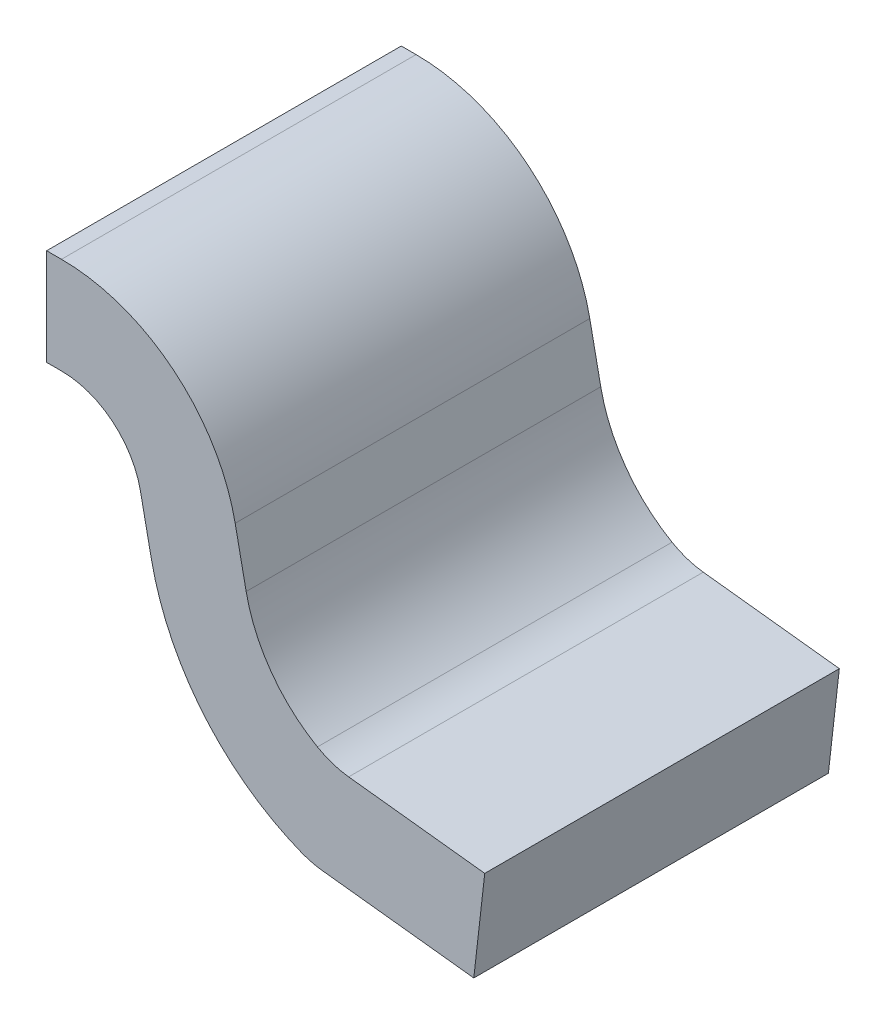
ISO-10303-21;
HEADER;
FILE_DESCRIPTION(('STEP AP214'),'2;1');
FILE_NAME('part.step','',(''),(''),'','','');
FILE_SCHEMA(('AUTOMOTIVE_DESIGN { 1 0 10303 214 1 1 1 1 }'));
ENDSEC;
DATA;
#1=APPLICATION_CONTEXT('core data for automotive mechanical design processes');
#2=APPLICATION_PROTOCOL_DEFINITION('international standard','automotive_design',2000,#1);
#3=PRODUCT_CONTEXT('',#1,'mechanical');
#4=PRODUCT('Part','Part','',(#3));
#5=PRODUCT_RELATED_PRODUCT_CATEGORY('part','',(#4));
#6=PRODUCT_DEFINITION_FORMATION('','',#4);
#7=PRODUCT_DEFINITION_CONTEXT('part definition',#1,'design');
#8=PRODUCT_DEFINITION('design','',#6,#7);
#9=PRODUCT_DEFINITION_SHAPE('','',#8);
#10=(LENGTH_UNIT() NAMED_UNIT(*) SI_UNIT(.MILLI.,.METRE.));
#11=(NAMED_UNIT(*) PLANE_ANGLE_UNIT() SI_UNIT($,.RADIAN.));
#12=(NAMED_UNIT(*) SI_UNIT($,.STERADIAN.) SOLID_ANGLE_UNIT());
#13=UNCERTAINTY_MEASURE_WITH_UNIT(LENGTH_MEASURE(1.E-05),#10,'distance_accuracy_value','');
#14=(GEOMETRIC_REPRESENTATION_CONTEXT(3) GLOBAL_UNCERTAINTY_ASSIGNED_CONTEXT((#13)) GLOBAL_UNIT_ASSIGNED_CONTEXT((#10,
#11,#12)) REPRESENTATION_CONTEXT('',''));
#15=CARTESIAN_POINT('',(0.,0.,0.));
#16=DIRECTION('',(0.,0.,1.));
#17=DIRECTION('',(1.,0.,0.));
#18=AXIS2_PLACEMENT_3D('',#15,#16,#17);
#19=CARTESIAN_POINT('',(1.0784798395513,0.311122151443952,3.64984430510635));
#20=DIRECTION('',(0.,0.,-1.));
#21=DIRECTION('',(-1.,0.,0.));
#22=AXIS2_PLACEMENT_3D('',#19,#20,#21);
#23=CYLINDRICAL_SURFACE('',#22,0.304673812487565);
#24=DIRECTION('',(0.,0.,-1.));
#25=VECTOR('',#24,1.);
#26=CARTESIAN_POINT('',(0.78,0.25,3.64984430510635));
#27=LINE('',#26,#25);
#28=CARTESIAN_POINT('',(0.78,0.25,1.67));
#29=VERTEX_POINT('',#28);
#30=CARTESIAN_POINT('',(0.78,0.25,1.23));
#31=VERTEX_POINT('',#30);
#32=EDGE_CURVE('E11',#29,#31,#27,.T.);
#33=ORIENTED_EDGE('',*,*,#32,.T.);
#34=CARTESIAN_POINT('',(1.0784798395513,0.311122151443952,1.23));
#35=DIRECTION('',(0.,0.,1.));
#36=DIRECTION('',(-1.,0.,0.));
#37=AXIS2_PLACEMENT_3D('',#34,#35,#36);
#38=CIRCLE('',#37,0.304673812487565);
#39=CARTESIAN_POINT('',(0.966363747755728,0.0278270509282633,1.23));
#40=VERTEX_POINT('',#39);
#41=EDGE_CURVE('E26',#31,#40,#38,.T.);
#42=ORIENTED_EDGE('',*,*,#41,.T.);
#43=DIRECTION('',(0.,0.,1.));
#44=VECTOR('',#43,1.);
#45=CARTESIAN_POINT('',(0.966363747755728,0.0278270509282633,3.64984430510635));
#46=LINE('',#45,#44);
#47=CARTESIAN_POINT('',(0.966363747755728,0.0278270509282633,1.67));
#48=VERTEX_POINT('',#47);
#49=EDGE_CURVE('E224',#40,#48,#46,.T.);
#50=ORIENTED_EDGE('',*,*,#49,.T.);
#51=CARTESIAN_POINT('',(1.0784798395513,0.311122151443952,1.67));
#52=DIRECTION('',(0.,0.,-1.));
#53=DIRECTION('',(-1.,0.,0.));
#54=AXIS2_PLACEMENT_3D('',#51,#52,#53);
#55=CIRCLE('',#54,0.304673812487565);
#56=EDGE_CURVE('E220',#48,#29,#55,.T.);
#57=ORIENTED_EDGE('',*,*,#56,.T.);
#58=EDGE_LOOP('',(#33,#42,#50,#57));
#59=FACE_BOUND('',#58,.T.);
#60=ADVANCED_FACE('F16',(#59),#23,.T.);
#61=CARTESIAN_POINT('',(-2.74150408033977,0.,1.23));
#62=DIRECTION('',(0.,0.,1.));
#63=DIRECTION('',(0.707106781186548,0.707106781186548,0.));
#64=AXIS2_PLACEMENT_3D('',#61,#62,#63);
#65=PLANE('',#64);
#66=DIRECTION('',(-1.,0.,0.));
#67=VECTOR('',#66,1.);
#68=CARTESIAN_POINT('',(-2.74150408033977,0.5165,1.23));
#69=LINE('',#68,#67);
#70=CARTESIAN_POINT('',(0.668402642734686,0.5165,1.23));
#71=VERTEX_POINT('',#70);
#72=CARTESIAN_POINT('',(0.65,0.5165,1.23));
#73=VERTEX_POINT('',#72);
#74=EDGE_CURVE('E189',#71,#73,#69,.T.);
#75=ORIENTED_EDGE('',*,*,#74,.F.);
#76=CARTESIAN_POINT('',(0.668402642734686,0.2965,1.23));
#77=DIRECTION('',(0.,0.,1.));
#78=DIRECTION('',(-1.,0.,0.));
#79=AXIS2_PLACEMENT_3D('',#76,#77,#78);
#80=CIRCLE('',#79,0.22);
#81=CARTESIAN_POINT('',(0.883930075713411,0.340635310507588,1.23));
#82=VERTEX_POINT('',#81);
#83=EDGE_CURVE('E199',#82,#71,#80,.T.);
#84=ORIENTED_EDGE('',*,*,#83,.F.);
#85=DIRECTION('',(-0.20061504776177,0.979670149903294,0.));
#86=VECTOR('',#85,1.);
#87=CARTESIAN_POINT('',(0.897560417988396,0.274073805731412,1.23));
#88=LINE('',#87,#86);
#89=CARTESIAN_POINT('',(0.897560417988396,0.274073805731411,1.23));
#90=VERTEX_POINT('',#89);
#91=EDGE_CURVE('E178',#90,#82,#88,.T.);
#92=ORIENTED_EDGE('',*,*,#91,.F.);
#93=CARTESIAN_POINT('',(1.0784798395513,0.311122151443952,1.23));
#94=DIRECTION('',(0.,0.,-1.));
#95=DIRECTION('',(-1.,0.,0.));
#96=AXIS2_PLACEMENT_3D('',#93,#94,#95);
#97=CIRCLE('',#96,0.184673812487565);
#98=CARTESIAN_POINT('',(0.985979267087511,0.151284542876497,1.23));
#99=VERTEX_POINT('',#98);
#100=EDGE_CURVE('E179',#99,#90,#97,.T.);
#101=ORIENTED_EDGE('',*,*,#100,.F.);
#102=CARTESIAN_POINT('',(1.03606789157509,0.237835855384987,1.23));
#103=DIRECTION('',(0.,0.,-1.));
#104=DIRECTION('',(-1.,0.,0.));
#105=AXIS2_PLACEMENT_3D('',#102,#103,#104);
#106=CIRCLE('',#105,0.1);
#107=CARTESIAN_POINT('',(1.02473971532561,0.138479565081551,1.23));
#108=VERTEX_POINT('',#107);
#109=EDGE_CURVE('E174',#108,#99,#106,.T.);
#110=ORIENTED_EDGE('',*,*,#109,.F.);
#111=DIRECTION('',(-0.993562903034363,0.113281762494801,0.));
#112=VECTOR('',#111,1.);
#113=CARTESIAN_POINT('',(1.19359381149938,0.119227548364125,1.23));
#114=LINE('',#113,#112);
#115=CARTESIAN_POINT('',(1.19359381149938,0.119227548364125,1.23));
#116=VERTEX_POINT('',#115);
#117=EDGE_CURVE('E169',#116,#108,#114,.T.);
#118=ORIENTED_EDGE('',*,*,#117,.F.);
#119=DIRECTION('',(0.113281762495857,0.993562903034243,0.));
#120=VECTOR('',#119,1.);
#121=CARTESIAN_POINT('',(1.17999999999987,0.,1.23));
#122=LINE('',#121,#120);
#123=CARTESIAN_POINT('',(1.17999999999992,0.,1.23));
#124=VERTEX_POINT('',#123);
#125=EDGE_CURVE('E164',#124,#116,#122,.T.);
#126=ORIENTED_EDGE('',*,*,#125,.F.);
#127=DIRECTION('',(0.993562903034357,-0.113281762494854,0.));
#128=VECTOR('',#127,1.);
#129=CARTESIAN_POINT('',(0.991834300901524,0.0214538424993981,1.23));
#130=LINE('',#129,#128);
#131=CARTESIAN_POINT('',(0.991834300901522,0.0214538424993983,1.23));
#132=VERTEX_POINT('',#131);
#133=EDGE_CURVE('E159',#132,#124,#130,.T.);
#134=ORIENTED_EDGE('',*,*,#133,.F.);
#135=CARTESIAN_POINT('',(1.003162477151,0.120810132802834,1.23));
#136=DIRECTION('',(0.,0.,1.));
#137=DIRECTION('',(-1.,0.,0.));
#138=AXIS2_PLACEMENT_3D('',#135,#136,#137);
#139=CIRCLE('',#138,0.1);
#140=EDGE_CURVE('E150',#40,#132,#139,.T.);
#141=ORIENTED_EDGE('',*,*,#140,.F.);
#142=ORIENTED_EDGE('',*,*,#41,.F.);
#143=DIRECTION('',(0.200615047761769,-0.979670149903294,0.));
#144=VECTOR('',#143,1.);
#145=CARTESIAN_POINT('',(0.766369657725015,0.316561504776176,1.23));
#146=LINE('',#145,#144);
#147=CARTESIAN_POINT('',(0.766369657725015,0.316561504776177,1.23));
#148=VERTEX_POINT('',#147);
#149=EDGE_CURVE('E149',#148,#31,#146,.T.);
#150=ORIENTED_EDGE('',*,*,#149,.F.);
#151=CARTESIAN_POINT('',(0.668402642734686,0.2965,1.23));
#152=DIRECTION('',(0.,0.,-1.));
#153=DIRECTION('',(-1.,0.,0.));
#154=AXIS2_PLACEMENT_3D('',#151,#152,#153);
#155=CIRCLE('',#154,0.1);
#156=CARTESIAN_POINT('',(0.668402642734686,0.3965,1.23));
#157=VERTEX_POINT('',#156);
#158=EDGE_CURVE('E134',#157,#148,#155,.T.);
#159=ORIENTED_EDGE('',*,*,#158,.F.);
#160=DIRECTION('',(1.,0.,0.));
#161=VECTOR('',#160,1.);
#162=CARTESIAN_POINT('',(-2.74150408033977,0.3965,1.23));
#163=LINE('',#162,#161);
#164=CARTESIAN_POINT('',(0.65,0.3965,1.23));
#165=VERTEX_POINT('',#164);
#166=EDGE_CURVE('E136',#165,#157,#163,.T.);
#167=ORIENTED_EDGE('',*,*,#166,.F.);
#168=DIRECTION('',(0.,-1.,0.));
#169=VECTOR('',#168,1.);
#170=CARTESIAN_POINT('',(0.65,0.,1.23));
#171=LINE('',#170,#169);
#172=EDGE_CURVE('E143',#73,#165,#171,.T.);
#173=ORIENTED_EDGE('',*,*,#172,.F.);
#174=EDGE_LOOP('',(#75,#84,#92,#101,#110,#118,#126,#134,#141,#142,#150,#159,#167,#173));
#175=FACE_BOUND('',#174,.T.);
#176=ADVANCED_FACE('F243',(#175),#65,.F.);
#177=CARTESIAN_POINT('',(0.766369657725015,0.316561504776176,3.64984430510635));
#178=DIRECTION('',(0.979670149903295,0.200615047761767,0.));
#179=DIRECTION('',(-0.143305470647058,0.699808381659803,0.699808381659803));
#180=AXIS2_PLACEMENT_3D('',#177,#178,#179);
#181=PLANE('',#180);
#182=DIRECTION('',(0.200615047761767,-0.979670149903295,0.));
#183=VECTOR('',#182,1.);
#184=CARTESIAN_POINT('',(0.766369657725015,0.316561504776176,1.67));
#185=LINE('',#184,#183);
#186=CARTESIAN_POINT('',(0.766369657725015,0.316561504776177,1.67));
#187=VERTEX_POINT('',#186);
#188=EDGE_CURVE('E147',#187,#29,#185,.T.);
#189=ORIENTED_EDGE('',*,*,#188,.F.);
#190=DIRECTION('',(0.,0.,1.));
#191=VECTOR('',#190,1.);
#192=CARTESIAN_POINT('',(0.766369657725015,0.316561504776176,3.64984430510635));
#193=LINE('',#192,#191);
#194=EDGE_CURVE('E125',#148,#187,#193,.T.);
#195=ORIENTED_EDGE('',*,*,#194,.F.);
#196=ORIENTED_EDGE('',*,*,#149,.T.);
#197=ORIENTED_EDGE('',*,*,#32,.F.);
#198=EDGE_LOOP('',(#189,#195,#196,#197));
#199=FACE_BOUND('',#198,.T.);
#200=ADVANCED_FACE('F264',(#199),#181,.F.);
#201=CARTESIAN_POINT('',(-2.74150408033977,0.,1.67));
#202=DIRECTION('',(0.,0.,-1.));
#203=DIRECTION('',(0.707106781186548,0.707106781186548,0.));
#204=AXIS2_PLACEMENT_3D('',#201,#202,#203);
#205=PLANE('',#204);
#206=ORIENTED_EDGE('',*,*,#188,.T.);
#207=ORIENTED_EDGE('',*,*,#56,.F.);
#208=CARTESIAN_POINT('',(1.003162477151,0.120810132802834,1.67));
#209=DIRECTION('',(0.,0.,-1.));
#210=DIRECTION('',(-1.,0.,0.));
#211=AXIS2_PLACEMENT_3D('',#208,#209,#210);
#212=CIRCLE('',#211,0.1);
#213=CARTESIAN_POINT('',(0.991834300901522,0.0214538424993983,1.67));
#214=VERTEX_POINT('',#213);
#215=EDGE_CURVE('E152',#214,#48,#212,.T.);
#216=ORIENTED_EDGE('',*,*,#215,.F.);
#217=DIRECTION('',(-0.993562903034357,0.113281762494854,0.));
#218=VECTOR('',#217,1.);
#219=CARTESIAN_POINT('',(1.17999999999987,0.,1.67));
#220=LINE('',#219,#218);
#221=CARTESIAN_POINT('',(1.17999999999992,0.,1.67));
#222=VERTEX_POINT('',#221);
#223=EDGE_CURVE('E156',#222,#214,#220,.T.);
#224=ORIENTED_EDGE('',*,*,#223,.F.);
#225=DIRECTION('',(-0.113281762495857,-0.993562903034243,0.));
#226=VECTOR('',#225,1.);
#227=CARTESIAN_POINT('',(1.19359381149938,0.119227548364125,1.67));
#228=LINE('',#227,#226);
#229=CARTESIAN_POINT('',(1.19359381149938,0.119227548364125,1.67));
#230=VERTEX_POINT('',#229);
#231=EDGE_CURVE('E160',#230,#222,#228,.T.);
#232=ORIENTED_EDGE('',*,*,#231,.F.);
#233=DIRECTION('',(0.993562903034363,-0.113281762494801,0.));
#234=VECTOR('',#233,1.);
#235=CARTESIAN_POINT('',(1.02473971532561,0.138479565081551,1.67));
#236=LINE('',#235,#234);
#237=CARTESIAN_POINT('',(1.02473971532561,0.138479565081551,1.67));
#238=VERTEX_POINT('',#237);
#239=EDGE_CURVE('E165',#238,#230,#236,.T.);
#240=ORIENTED_EDGE('',*,*,#239,.F.);
#241=CARTESIAN_POINT('',(1.03606789157509,0.237835855384987,1.67));
#242=DIRECTION('',(0.,0.,1.));
#243=DIRECTION('',(-1.,0.,0.));
#244=AXIS2_PLACEMENT_3D('',#241,#242,#243);
#245=CIRCLE('',#244,0.1);
#246=CARTESIAN_POINT('',(0.985979267087511,0.151284542876497,1.67));
#247=VERTEX_POINT('',#246);
#248=EDGE_CURVE('E170',#247,#238,#245,.T.);
#249=ORIENTED_EDGE('',*,*,#248,.F.);
#250=CARTESIAN_POINT('',(1.0784798395513,0.311122151443952,1.67));
#251=DIRECTION('',(0.,0.,1.));
#252=DIRECTION('',(-1.,0.,0.));
#253=AXIS2_PLACEMENT_3D('',#250,#251,#252);
#254=CIRCLE('',#253,0.184673812487565);
#255=CARTESIAN_POINT('',(0.897560417988396,0.274073805731411,1.67));
#256=VERTEX_POINT('',#255);
#257=EDGE_CURVE('E175',#256,#247,#254,.T.);
#258=ORIENTED_EDGE('',*,*,#257,.F.);
#259=DIRECTION('',(0.20061504776177,-0.979670149903294,0.));
#260=VECTOR('',#259,1.);
#261=CARTESIAN_POINT('',(0.883930075713411,0.340635310507587,1.67));
#262=LINE('',#261,#260);
#263=CARTESIAN_POINT('',(0.883930075713411,0.340635310507588,1.67));
#264=VERTEX_POINT('',#263);
#265=EDGE_CURVE('E180',#264,#256,#262,.T.);
#266=ORIENTED_EDGE('',*,*,#265,.F.);
#267=CARTESIAN_POINT('',(0.668402642734686,0.2965,1.67));
#268=DIRECTION('',(0.,0.,-1.));
#269=DIRECTION('',(-1.,0.,0.));
#270=AXIS2_PLACEMENT_3D('',#267,#268,#269);
#271=CIRCLE('',#270,0.22);
#272=CARTESIAN_POINT('',(0.668402642734686,0.5165,1.67));
#273=VERTEX_POINT('',#272);
#274=EDGE_CURVE('E183',#273,#264,#271,.T.);
#275=ORIENTED_EDGE('',*,*,#274,.F.);
#276=DIRECTION('',(1.,0.,0.));
#277=VECTOR('',#276,1.);
#278=CARTESIAN_POINT('',(-2.74150408033977,0.5165,1.67));
#279=LINE('',#278,#277);
#280=CARTESIAN_POINT('',(0.65,0.5165,1.67));
#281=VERTEX_POINT('',#280);
#282=EDGE_CURVE('E146',#281,#273,#279,.T.);
#283=ORIENTED_EDGE('',*,*,#282,.F.);
#284=DIRECTION('',(0.,1.,0.));
#285=VECTOR('',#284,1.);
#286=CARTESIAN_POINT('',(0.65,0.,1.67));
#287=LINE('',#286,#285);
#288=CARTESIAN_POINT('',(0.65,0.3965,1.67));
#289=VERTEX_POINT('',#288);
#290=EDGE_CURVE('E123',#289,#281,#287,.T.);
#291=ORIENTED_EDGE('',*,*,#290,.F.);
#292=DIRECTION('',(-1.,0.,0.));
#293=VECTOR('',#292,1.);
#294=CARTESIAN_POINT('',(-2.74150408033977,0.3965,1.67));
#295=LINE('',#294,#293);
#296=CARTESIAN_POINT('',(0.668402642734686,0.3965,1.67));
#297=VERTEX_POINT('',#296);
#298=EDGE_CURVE('E114',#297,#289,#295,.T.);
#299=ORIENTED_EDGE('',*,*,#298,.F.);
#300=CARTESIAN_POINT('',(0.668402642734686,0.2965,1.67));
#301=DIRECTION('',(0.,0.,1.));
#302=DIRECTION('',(-1.,0.,0.));
#303=AXIS2_PLACEMENT_3D('',#300,#301,#302);
#304=CIRCLE('',#303,0.1);
#305=EDGE_CURVE('E121',#187,#297,#304,.T.);
#306=ORIENTED_EDGE('',*,*,#305,.F.);
#307=EDGE_LOOP('',(#206,#207,#216,#224,#232,#240,#249,#258,#266,#275,#283,#291,#299,#306));
#308=FACE_BOUND('',#307,.T.);
#309=ADVANCED_FACE('F120',(#308),#205,.F.);
#310=CARTESIAN_POINT('',(1.003162477151,0.120810132802834,3.64984430510635));
#311=DIRECTION('',(0.,0.,-1.));
#312=DIRECTION('',(-1.,0.,0.));
#313=AXIS2_PLACEMENT_3D('',#310,#311,#312);
#314=CYLINDRICAL_SURFACE('',#313,0.1);
#315=ORIENTED_EDGE('',*,*,#49,.F.);
#316=ORIENTED_EDGE('',*,*,#140,.T.);
#317=DIRECTION('',(0.,0.,1.));
#318=VECTOR('',#317,1.);
#319=CARTESIAN_POINT('',(0.991834300901524,0.0214538424993981,3.64984430510635));
#320=LINE('',#319,#318);
#321=EDGE_CURVE('E155',#132,#214,#320,.T.);
#322=ORIENTED_EDGE('',*,*,#321,.T.);
#323=ORIENTED_EDGE('',*,*,#215,.T.);
#324=EDGE_LOOP('',(#315,#316,#322,#323));
#325=FACE_BOUND('',#324,.T.);
#326=ADVANCED_FACE('F267',(#325),#314,.T.);
#327=CARTESIAN_POINT('',(0.65,0.5165,3.64984430510635));
#328=DIRECTION('',(1.,0.,0.));
#329=DIRECTION('',(0.,0.707106781186548,0.707106781186548));
#330=AXIS2_PLACEMENT_3D('',#327,#328,#329);
#331=PLANE('',#330);
#332=ORIENTED_EDGE('',*,*,#290,.T.);
#333=DIRECTION('',(0.,0.,1.));
#334=VECTOR('',#333,1.);
#335=CARTESIAN_POINT('',(0.65,0.5165,3.64984430510635));
#336=LINE('',#335,#334);
#337=EDGE_CURVE('E193',#73,#281,#336,.T.);
#338=ORIENTED_EDGE('',*,*,#337,.F.);
#339=ORIENTED_EDGE('',*,*,#172,.T.);
#340=DIRECTION('',(0.,0.,-1.));
#341=VECTOR('',#340,1.);
#342=CARTESIAN_POINT('',(0.65,0.3965,3.64984430510635));
#343=LINE('',#342,#341);
#344=EDGE_CURVE('E126',#289,#165,#343,.T.);
#345=ORIENTED_EDGE('',*,*,#344,.F.);
#346=EDGE_LOOP('',(#332,#338,#339,#345));
#347=FACE_BOUND('',#346,.T.);
#348=ADVANCED_FACE('F263',(#347),#331,.F.);
#349=CARTESIAN_POINT('',(0.65,0.5165,3.64984430510635));
#350=DIRECTION('',(0.,-1.,0.));
#351=DIRECTION('',(0.707106781186548,0.,0.707106781186548));
#352=AXIS2_PLACEMENT_3D('',#349,#350,#351);
#353=PLANE('',#352);
#354=ORIENTED_EDGE('',*,*,#282,.T.);
#355=DIRECTION('',(0.,0.,1.));
#356=VECTOR('',#355,1.);
#357=CARTESIAN_POINT('',(0.668402642734685,0.5165,3.64984430510635));
#358=LINE('',#357,#356);
#359=EDGE_CURVE('E186',#71,#273,#358,.T.);
#360=ORIENTED_EDGE('',*,*,#359,.F.);
#361=ORIENTED_EDGE('',*,*,#74,.T.);
#362=ORIENTED_EDGE('',*,*,#337,.T.);
#363=EDGE_LOOP('',(#354,#360,#361,#362));
#364=FACE_BOUND('',#363,.T.);
#365=ADVANCED_FACE('F259',(#364),#353,.F.);
#366=CARTESIAN_POINT('',(0.668402642734686,0.2965,3.64984430510635));
#367=DIRECTION('',(0.,0.,-1.));
#368=DIRECTION('',(-1.,0.,0.));
#369=AXIS2_PLACEMENT_3D('',#366,#367,#368);
#370=CYLINDRICAL_SURFACE('',#369,0.22);
#371=DIRECTION('',(0.,0.,-1.));
#372=VECTOR('',#371,1.);
#373=CARTESIAN_POINT('',(0.883930075713411,0.340635310507587,3.64984430510635));
#374=LINE('',#373,#372);
#375=EDGE_CURVE('E195',#264,#82,#374,.T.);
#376=ORIENTED_EDGE('',*,*,#375,.T.);
#377=ORIENTED_EDGE('',*,*,#83,.T.);
#378=ORIENTED_EDGE('',*,*,#359,.T.);
#379=ORIENTED_EDGE('',*,*,#274,.T.);
#380=EDGE_LOOP('',(#376,#377,#378,#379));
#381=FACE_BOUND('',#380,.T.);
#382=ADVANCED_FACE('F256',(#381),#370,.T.);
#383=CARTESIAN_POINT('',(0.883930075713411,0.340635310507587,3.64984430510635));
#384=DIRECTION('',(-0.979670149903295,-0.200615047761767,0.));
#385=DIRECTION('',(-0.143305470647059,0.699808381659803,0.699808381659803));
#386=AXIS2_PLACEMENT_3D('',#383,#384,#385);
#387=PLANE('',#386);
#388=ORIENTED_EDGE('',*,*,#265,.T.);
#389=DIRECTION('',(0.,0.,1.));
#390=VECTOR('',#389,1.);
#391=CARTESIAN_POINT('',(0.897560417988396,0.274073805731412,3.64984430510635));
#392=LINE('',#391,#390);
#393=EDGE_CURVE('E173',#90,#256,#392,.T.);
#394=ORIENTED_EDGE('',*,*,#393,.F.);
#395=ORIENTED_EDGE('',*,*,#91,.T.);
#396=ORIENTED_EDGE('',*,*,#375,.F.);
#397=EDGE_LOOP('',(#388,#394,#395,#396));
#398=FACE_BOUND('',#397,.T.);
#399=ADVANCED_FACE('F252',(#398),#387,.F.);
#400=CARTESIAN_POINT('',(1.0784798395513,0.311122151443952,3.64984430510635));
#401=DIRECTION('',(0.,0.,-1.));
#402=DIRECTION('',(-1.,0.,0.));
#403=AXIS2_PLACEMENT_3D('',#400,#401,#402);
#404=CYLINDRICAL_SURFACE('',#403,0.184673812487565);
#405=ORIENTED_EDGE('',*,*,#257,.T.);
#406=DIRECTION('',(0.,0.,1.));
#407=VECTOR('',#406,1.);
#408=CARTESIAN_POINT('',(0.985979267087511,0.151284542876497,3.64984430510635));
#409=LINE('',#408,#407);
#410=EDGE_CURVE('E168',#99,#247,#409,.T.);
#411=ORIENTED_EDGE('',*,*,#410,.F.);
#412=ORIENTED_EDGE('',*,*,#100,.T.);
#413=ORIENTED_EDGE('',*,*,#393,.T.);
#414=EDGE_LOOP('',(#405,#411,#412,#413));
#415=FACE_BOUND('',#414,.T.);
#416=ADVANCED_FACE('F249',(#415),#404,.F.);
#417=CARTESIAN_POINT('',(1.03606789157509,0.237835855384987,3.64984430510635));
#418=DIRECTION('',(0.,0.,-1.));
#419=DIRECTION('',(-1.,0.,0.));
#420=AXIS2_PLACEMENT_3D('',#417,#418,#419);
#421=CYLINDRICAL_SURFACE('',#420,0.1);
#422=ORIENTED_EDGE('',*,*,#248,.T.);
#423=DIRECTION('',(0.,0.,1.));
#424=VECTOR('',#423,1.);
#425=CARTESIAN_POINT('',(1.02473971532561,0.138479565081551,3.64984430510635));
#426=LINE('',#425,#424);
#427=EDGE_CURVE('E163',#108,#238,#426,.T.);
#428=ORIENTED_EDGE('',*,*,#427,.F.);
#429=ORIENTED_EDGE('',*,*,#109,.T.);
#430=ORIENTED_EDGE('',*,*,#410,.T.);
#431=EDGE_LOOP('',(#422,#428,#429,#430));
#432=FACE_BOUND('',#431,.T.);
#433=ADVANCED_FACE('F247',(#432),#421,.F.);
#434=CARTESIAN_POINT('',(1.19359381149938,0.119227548364123,3.64984430510635));
#435=DIRECTION('',(-0.113281762494812,-0.993562903034362,0.));
#436=DIRECTION('',(0.704819900881673,-0.0803605291315244,0.704819900881673));
#437=AXIS2_PLACEMENT_3D('',#434,#435,#436);
#438=PLANE('',#437);
#439=ORIENTED_EDGE('',*,*,#239,.T.);
#440=DIRECTION('',(0.,0.,1.));
#441=VECTOR('',#440,1.);
#442=CARTESIAN_POINT('',(1.19359381149938,0.119227548364123,3.64984430510635));
#443=LINE('',#442,#441);
#444=EDGE_CURVE('E158',#116,#230,#443,.T.);
#445=ORIENTED_EDGE('',*,*,#444,.F.);
#446=ORIENTED_EDGE('',*,*,#117,.T.);
#447=ORIENTED_EDGE('',*,*,#427,.T.);
#448=EDGE_LOOP('',(#439,#445,#446,#447));
#449=FACE_BOUND('',#448,.T.);
#450=ADVANCED_FACE('F239',(#449),#438,.F.);
#451=CARTESIAN_POINT('',(1.19359381149938,0.119227548364123,3.64984430510635));
#452=DIRECTION('',(-0.993562903034362,0.113281762494813,0.));
#453=DIRECTION('',(0.080360529131525,0.704819900881673,0.704819900881673));
#454=AXIS2_PLACEMENT_3D('',#451,#452,#453);
#455=PLANE('',#454);
#456=ORIENTED_EDGE('',*,*,#231,.T.);
#457=DIRECTION('',(0.,0.,1.));
#458=VECTOR('',#457,1.);
#459=CARTESIAN_POINT('',(1.18,0.,3.64984430510635));
#460=LINE('',#459,#458);
#461=EDGE_CURVE('E133',#124,#222,#460,.T.);
#462=ORIENTED_EDGE('',*,*,#461,.F.);
#463=ORIENTED_EDGE('',*,*,#125,.T.);
#464=ORIENTED_EDGE('',*,*,#444,.T.);
#465=EDGE_LOOP('',(#456,#462,#463,#464));
#466=FACE_BOUND('',#465,.T.);
#467=ADVANCED_FACE('F270',(#466),#455,.F.);
#468=CARTESIAN_POINT('',(1.18,0.,3.64984430510635));
#469=DIRECTION('',(0.113281762494813,0.993562903034362,0.));
#470=DIRECTION('',(0.704819900881673,-0.0803605291315247,0.704819900881673));
#471=AXIS2_PLACEMENT_3D('',#468,#469,#470);
#472=PLANE('',#471);
#473=ORIENTED_EDGE('',*,*,#223,.T.);
#474=ORIENTED_EDGE('',*,*,#321,.F.);
#475=ORIENTED_EDGE('',*,*,#133,.T.);
#476=ORIENTED_EDGE('',*,*,#461,.T.);
#477=EDGE_LOOP('',(#473,#474,#475,#476));
#478=FACE_BOUND('',#477,.T.);
#479=ADVANCED_FACE('F268',(#478),#472,.F.);
#480=CARTESIAN_POINT('',(0.668402642734686,0.2965,3.64984430510635));
#481=DIRECTION('',(0.,0.,-1.));
#482=DIRECTION('',(-1.,0.,0.));
#483=AXIS2_PLACEMENT_3D('',#480,#481,#482);
#484=CYLINDRICAL_SURFACE('',#483,0.1);
#485=ORIENTED_EDGE('',*,*,#305,.T.);
#486=DIRECTION('',(0.,0.,1.));
#487=VECTOR('',#486,1.);
#488=CARTESIAN_POINT('',(0.668402642734685,0.3965,3.64984430510635));
#489=LINE('',#488,#487);
#490=EDGE_CURVE('E20',#157,#297,#489,.T.);
#491=ORIENTED_EDGE('',*,*,#490,.F.);
#492=ORIENTED_EDGE('',*,*,#158,.T.);
#493=ORIENTED_EDGE('',*,*,#194,.T.);
#494=EDGE_LOOP('',(#485,#491,#492,#493));
#495=FACE_BOUND('',#494,.T.);
#496=ADVANCED_FACE('F130',(#495),#484,.F.);
#497=CARTESIAN_POINT('',(0.65,0.3965,3.64984430510635));
#498=DIRECTION('',(0.,1.,0.));
#499=DIRECTION('',(0.707106781186548,0.,0.707106781186548));
#500=AXIS2_PLACEMENT_3D('',#497,#498,#499);
#501=PLANE('',#500);
#502=ORIENTED_EDGE('',*,*,#298,.T.);
#503=ORIENTED_EDGE('',*,*,#344,.T.);
#504=ORIENTED_EDGE('',*,*,#166,.T.);
#505=ORIENTED_EDGE('',*,*,#490,.T.);
#506=EDGE_LOOP('',(#502,#503,#504,#505));
#507=FACE_BOUND('',#506,.T.);
#508=ADVANCED_FACE('F18',(#507),#501,.F.);
#509=CLOSED_SHELL('',(#60,#176,#200,#309,#326,#348,#365,#382,#399,#416,#433,#450,#467,#479,#496,#508));
#510=MANIFOLD_SOLID_BREP('B1',#509);
#511=ADVANCED_BREP_SHAPE_REPRESENTATION('',(#18,#510),#14);
#512=SHAPE_DEFINITION_REPRESENTATION(#9,#511);
ENDSEC;
END-ISO-10303-21;
